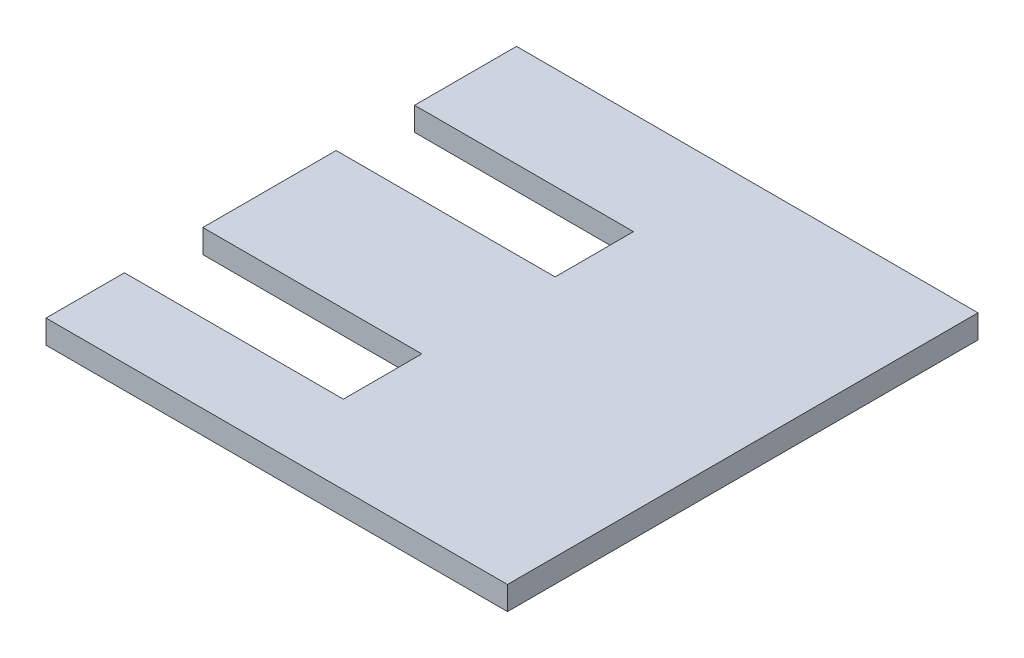
ISO-10303-21;
HEADER;
FILE_DESCRIPTION(('STEP AP214'),'2;1');
FILE_NAME('part.step','',(''),(''),'','','');
FILE_SCHEMA(('AUTOMOTIVE_DESIGN { 1 0 10303 214 1 1 1 1 }'));
ENDSEC;
DATA;
#1=APPLICATION_CONTEXT('core data for automotive mechanical design processes');
#2=APPLICATION_PROTOCOL_DEFINITION('international standard','automotive_design',2000,#1);
#3=PRODUCT_CONTEXT('',#1,'mechanical');
#4=PRODUCT('Part','Part','',(#3));
#5=PRODUCT_RELATED_PRODUCT_CATEGORY('part','',(#4));
#6=PRODUCT_DEFINITION_FORMATION('','',#4);
#7=PRODUCT_DEFINITION_CONTEXT('part definition',#1,'design');
#8=PRODUCT_DEFINITION('design','',#6,#7);
#9=PRODUCT_DEFINITION_SHAPE('','',#8);
#10=(LENGTH_UNIT() NAMED_UNIT(*) SI_UNIT(.MILLI.,.METRE.));
#11=(NAMED_UNIT(*) PLANE_ANGLE_UNIT() SI_UNIT($,.RADIAN.));
#12=(NAMED_UNIT(*) SI_UNIT($,.STERADIAN.) SOLID_ANGLE_UNIT());
#13=UNCERTAINTY_MEASURE_WITH_UNIT(LENGTH_MEASURE(1.E-05),#10,'distance_accuracy_value','');
#14=(GEOMETRIC_REPRESENTATION_CONTEXT(3) GLOBAL_UNCERTAINTY_ASSIGNED_CONTEXT((#13)) GLOBAL_UNIT_ASSIGNED_CONTEXT((#10,
#11,#12)) REPRESENTATION_CONTEXT('',''));
#15=CARTESIAN_POINT('',(0.,0.,0.));
#16=DIRECTION('',(0.,0.,1.));
#17=DIRECTION('',(1.,0.,0.));
#18=AXIS2_PLACEMENT_3D('',#15,#16,#17);
#19=CARTESIAN_POINT('',(-300.,46.99,40.));
#20=DIRECTION('',(0.,0.,-1.));
#21=DIRECTION('',(-1.,0.,0.));
#22=AXIS2_PLACEMENT_3D('',#19,#20,#21);
#23=PLANE('',#22);
#24=DIRECTION('',(0.,1.,0.));
#25=VECTOR('',#24,1.);
#26=CARTESIAN_POINT('',(-272.082574829783,46.99,40.));
#27=LINE('',#26,#25);
#28=CARTESIAN_POINT('',(-272.082574829783,47.,40.));
#29=VERTEX_POINT('',#28);
#30=CARTESIAN_POINT('',(-272.082574829783,50.,40.));
#31=VERTEX_POINT('',#30);
#32=EDGE_CURVE('E38',#29,#31,#27,.T.);
#33=ORIENTED_EDGE('',*,*,#32,.T.);
#34=DIRECTION('',(1.,0.,0.));
#35=VECTOR('',#34,1.);
#36=CARTESIAN_POINT('',(-300.,50.,40.));
#37=LINE('',#36,#35);
#38=CARTESIAN_POINT('',(-300.,50.,40.));
#39=VERTEX_POINT('',#38);
#40=EDGE_CURVE('E181',#39,#31,#37,.T.);
#41=ORIENTED_EDGE('',*,*,#40,.F.);
#42=DIRECTION('',(0.,-1.,0.));
#43=VECTOR('',#42,1.);
#44=CARTESIAN_POINT('',(-300.,46.99,40.));
#45=LINE('',#44,#43);
#46=CARTESIAN_POINT('',(-300.,47.,40.));
#47=VERTEX_POINT('',#46);
#48=EDGE_CURVE('E188',#39,#47,#45,.T.);
#49=ORIENTED_EDGE('',*,*,#48,.T.);
#50=DIRECTION('',(-1.,0.,0.));
#51=VECTOR('',#50,1.);
#52=CARTESIAN_POINT('',(300.,47.,40.));
#53=LINE('',#52,#51);
#54=EDGE_CURVE('E207',#29,#47,#53,.T.);
#55=ORIENTED_EDGE('',*,*,#54,.F.);
#56=EDGE_LOOP('',(#33,#41,#49,#55));
#57=FACE_BOUND('',#56,.T.);
#58=ADVANCED_FACE('F34',(#57),#23,.F.);
#59=CARTESIAN_POINT('',(-300.,46.99,50.));
#60=DIRECTION('',(0.,0.,1.));
#61=DIRECTION('',(1.,0.,0.));
#62=AXIS2_PLACEMENT_3D('',#59,#60,#61);
#63=PLANE('',#62);
#64=DIRECTION('',(0.,1.,0.));
#65=VECTOR('',#64,1.);
#66=CARTESIAN_POINT('',(-300.,46.99,50.));
#67=LINE('',#66,#65);
#68=CARTESIAN_POINT('',(-300.,47.,50.));
#69=VERTEX_POINT('',#68);
#70=CARTESIAN_POINT('',(-300.,50.,50.));
#71=VERTEX_POINT('',#70);
#72=EDGE_CURVE('E184',#69,#71,#67,.T.);
#73=ORIENTED_EDGE('',*,*,#72,.T.);
#74=DIRECTION('',(-1.,0.,0.));
#75=VECTOR('',#74,1.);
#76=CARTESIAN_POINT('',(-300.,50.,50.));
#77=LINE('',#76,#75);
#78=CARTESIAN_POINT('',(-272.082574829783,50.,50.));
#79=VERTEX_POINT('',#78);
#80=EDGE_CURVE('E171',#79,#71,#77,.T.);
#81=ORIENTED_EDGE('',*,*,#80,.F.);
#82=DIRECTION('',(0.,1.,0.));
#83=VECTOR('',#82,1.);
#84=CARTESIAN_POINT('',(-272.082574829783,46.99,50.));
#85=LINE('',#84,#83);
#86=CARTESIAN_POINT('',(-272.082574829783,47.,50.));
#87=VERTEX_POINT('',#86);
#88=EDGE_CURVE('E194',#87,#79,#85,.T.);
#89=ORIENTED_EDGE('',*,*,#88,.F.);
#90=DIRECTION('',(1.,0.,0.));
#91=VECTOR('',#90,1.);
#92=CARTESIAN_POINT('',(300.,47.,50.));
#93=LINE('',#92,#91);
#94=EDGE_CURVE('E137',#69,#87,#93,.T.);
#95=ORIENTED_EDGE('',*,*,#94,.F.);
#96=EDGE_LOOP('',(#73,#81,#89,#95));
#97=FACE_BOUND('',#96,.T.);
#98=ADVANCED_FACE('F219',(#97),#63,.F.);
#99=CARTESIAN_POINT('',(-272.082574829783,46.99,40.));
#100=DIRECTION('',(1.,0.,0.));
#101=DIRECTION('',(0.,0.,-1.));
#102=AXIS2_PLACEMENT_3D('',#99,#100,#101);
#103=PLANE('',#102);
#104=ORIENTED_EDGE('',*,*,#88,.T.);
#105=DIRECTION('',(0.,0.,1.));
#106=VECTOR('',#105,1.);
#107=CARTESIAN_POINT('',(-272.082574829783,50.,60.));
#108=LINE('',#107,#106);
#109=EDGE_CURVE('E209',#31,#79,#108,.T.);
#110=ORIENTED_EDGE('',*,*,#109,.F.);
#111=ORIENTED_EDGE('',*,*,#32,.F.);
#112=DIRECTION('',(0.,0.,-1.));
#113=VECTOR('',#112,1.);
#114=CARTESIAN_POINT('',(-272.082574829783,47.,3.));
#115=LINE('',#114,#113);
#116=EDGE_CURVE('E215',#87,#29,#115,.T.);
#117=ORIENTED_EDGE('',*,*,#116,.F.);
#118=EDGE_LOOP('',(#104,#110,#111,#117));
#119=FACE_BOUND('',#118,.T.);
#120=ADVANCED_FACE('F210',(#119),#103,.F.);
#121=CARTESIAN_POINT('',(-300.,46.99,23.));
#122=DIRECTION('',(0.,0.,1.));
#123=DIRECTION('',(1.,0.,0.));
#124=AXIS2_PLACEMENT_3D('',#121,#122,#123);
#125=PLANE('',#124);
#126=DIRECTION('',(0.,1.,0.));
#127=VECTOR('',#126,1.);
#128=CARTESIAN_POINT('',(-300.,46.99,23.));
#129=LINE('',#128,#127);
#130=CARTESIAN_POINT('',(-300.,47.,23.));
#131=VERTEX_POINT('',#130);
#132=CARTESIAN_POINT('',(-300.,50.,23.));
#133=VERTEX_POINT('',#132);
#134=EDGE_CURVE('E146',#131,#133,#129,.T.);
#135=ORIENTED_EDGE('',*,*,#134,.T.);
#136=DIRECTION('',(-1.,0.,0.));
#137=VECTOR('',#136,1.);
#138=CARTESIAN_POINT('',(-300.,50.,23.));
#139=LINE('',#138,#137);
#140=CARTESIAN_POINT('',(-272.082574829783,50.,23.));
#141=VERTEX_POINT('',#140);
#142=EDGE_CURVE('E157',#141,#133,#139,.T.);
#143=ORIENTED_EDGE('',*,*,#142,.F.);
#144=DIRECTION('',(0.,1.,0.));
#145=VECTOR('',#144,1.);
#146=CARTESIAN_POINT('',(-272.082574829783,46.99,23.));
#147=LINE('',#146,#145);
#148=CARTESIAN_POINT('',(-272.082574829783,47.,23.));
#149=VERTEX_POINT('',#148);
#150=EDGE_CURVE('E147',#149,#141,#147,.T.);
#151=ORIENTED_EDGE('',*,*,#150,.F.);
#152=DIRECTION('',(1.,0.,0.));
#153=VECTOR('',#152,1.);
#154=CARTESIAN_POINT('',(300.,47.,22.9999999999999));
#155=LINE('',#154,#153);
#156=EDGE_CURVE('E179',#131,#149,#155,.T.);
#157=ORIENTED_EDGE('',*,*,#156,.F.);
#158=EDGE_LOOP('',(#135,#143,#151,#157));
#159=FACE_BOUND('',#158,.T.);
#160=ADVANCED_FACE('F246',(#159),#125,.F.);
#161=CARTESIAN_POINT('',(-300.,46.99,13.));
#162=DIRECTION('',(0.,0.,-1.));
#163=DIRECTION('',(-1.,0.,0.));
#164=AXIS2_PLACEMENT_3D('',#161,#162,#163);
#165=PLANE('',#164);
#166=DIRECTION('',(0.,1.,0.));
#167=VECTOR('',#166,1.);
#168=CARTESIAN_POINT('',(-272.082574829783,46.99,13.));
#169=LINE('',#168,#167);
#170=CARTESIAN_POINT('',(-272.082574829783,47.,13.));
#171=VERTEX_POINT('',#170);
#172=CARTESIAN_POINT('',(-272.082574829783,50.,13.));
#173=VERTEX_POINT('',#172);
#174=EDGE_CURVE('E196',#171,#173,#169,.T.);
#175=ORIENTED_EDGE('',*,*,#174,.T.);
#176=DIRECTION('',(1.,0.,0.));
#177=VECTOR('',#176,1.);
#178=CARTESIAN_POINT('',(-300.,50.,13.));
#179=LINE('',#178,#177);
#180=CARTESIAN_POINT('',(-300.,50.,13.));
#181=VERTEX_POINT('',#180);
#182=EDGE_CURVE('E142',#181,#173,#179,.T.);
#183=ORIENTED_EDGE('',*,*,#182,.F.);
#184=DIRECTION('',(0.,-1.,0.));
#185=VECTOR('',#184,1.);
#186=CARTESIAN_POINT('',(-300.,46.99,13.));
#187=LINE('',#186,#185);
#188=CARTESIAN_POINT('',(-300.,47.,13.));
#189=VERTEX_POINT('',#188);
#190=EDGE_CURVE('E140',#181,#189,#187,.T.);
#191=ORIENTED_EDGE('',*,*,#190,.T.);
#192=DIRECTION('',(-1.,0.,0.));
#193=VECTOR('',#192,1.);
#194=CARTESIAN_POINT('',(300.,47.,13.));
#195=LINE('',#194,#193);
#196=EDGE_CURVE('E126',#171,#189,#195,.T.);
#197=ORIENTED_EDGE('',*,*,#196,.F.);
#198=EDGE_LOOP('',(#175,#183,#191,#197));
#199=FACE_BOUND('',#198,.T.);
#200=ADVANCED_FACE('F141',(#199),#165,.F.);
#201=CARTESIAN_POINT('',(-272.082574829783,46.99,13.));
#202=DIRECTION('',(1.,0.,0.));
#203=DIRECTION('',(0.,0.,-1.));
#204=AXIS2_PLACEMENT_3D('',#201,#202,#203);
#205=PLANE('',#204);
#206=ORIENTED_EDGE('',*,*,#150,.T.);
#207=DIRECTION('',(0.,0.,1.));
#208=VECTOR('',#207,1.);
#209=CARTESIAN_POINT('',(-272.082574829783,50.,60.));
#210=LINE('',#209,#208);
#211=EDGE_CURVE('E175',#173,#141,#210,.T.);
#212=ORIENTED_EDGE('',*,*,#211,.F.);
#213=ORIENTED_EDGE('',*,*,#174,.F.);
#214=DIRECTION('',(0.,0.,-1.));
#215=VECTOR('',#214,1.);
#216=CARTESIAN_POINT('',(-272.082574829783,47.,3.));
#217=LINE('',#216,#215);
#218=EDGE_CURVE('E133',#149,#171,#217,.T.);
#219=ORIENTED_EDGE('',*,*,#218,.F.);
#220=EDGE_LOOP('',(#206,#212,#213,#219));
#221=FACE_BOUND('',#220,.T.);
#222=ADVANCED_FACE('F244',(#221),#205,.F.);
#223=CARTESIAN_POINT('',(-241.153214372562,46.99,0.));
#224=DIRECTION('',(1.,0.,0.));
#225=DIRECTION('',(0.,0.,-1.));
#226=AXIS2_PLACEMENT_3D('',#223,#224,#225);
#227=PLANE('',#226);
#228=DIRECTION('',(0.,1.,0.));
#229=VECTOR('',#228,1.);
#230=CARTESIAN_POINT('',(-241.153214372562,46.99,60.));
#231=LINE('',#230,#229);
#232=CARTESIAN_POINT('',(-241.153214372562,47.,60.));
#233=VERTEX_POINT('',#232);
#234=CARTESIAN_POINT('',(-241.153214372562,50.,60.));
#235=VERTEX_POINT('',#234);
#236=EDGE_CURVE('E154',#233,#235,#231,.T.);
#237=ORIENTED_EDGE('',*,*,#236,.F.);
#238=DIRECTION('',(0.,0.,-1.));
#239=VECTOR('',#238,1.);
#240=CARTESIAN_POINT('',(-241.153214372562,47.,3.));
#241=LINE('',#240,#239);
#242=CARTESIAN_POINT('',(-241.153214372562,47.,0.));
#243=VERTEX_POINT('',#242);
#244=EDGE_CURVE('E217',#233,#243,#241,.T.);
#245=ORIENTED_EDGE('',*,*,#244,.T.);
#246=DIRECTION('',(0.,1.,0.));
#247=VECTOR('',#246,1.);
#248=CARTESIAN_POINT('',(-241.153214372562,46.99,0.));
#249=LINE('',#248,#247);
#250=CARTESIAN_POINT('',(-241.153214372562,50.,0.));
#251=VERTEX_POINT('',#250);
#252=EDGE_CURVE('E192',#243,#251,#249,.T.);
#253=ORIENTED_EDGE('',*,*,#252,.T.);
#254=DIRECTION('',(0.,0.,1.));
#255=VECTOR('',#254,1.);
#256=CARTESIAN_POINT('',(-241.153214372562,50.,60.));
#257=LINE('',#256,#255);
#258=EDGE_CURVE('E234',#251,#235,#257,.T.);
#259=ORIENTED_EDGE('',*,*,#258,.T.);
#260=EDGE_LOOP('',(#237,#245,#253,#259));
#261=FACE_BOUND('',#260,.T.);
#262=ADVANCED_FACE('F239',(#261),#227,.T.);
#263=CARTESIAN_POINT('',(-300.,0.,0.));
#264=DIRECTION('',(-1.,0.,0.));
#265=DIRECTION('',(0.,0.,1.));
#266=AXIS2_PLACEMENT_3D('',#263,#264,#265);
#267=PLANE('',#266);
#268=ORIENTED_EDGE('',*,*,#72,.F.);
#269=DIRECTION('',(0.,0.,1.));
#270=VECTOR('',#269,1.);
#271=CARTESIAN_POINT('',(-300.,47.,3.));
#272=LINE('',#271,#270);
#273=CARTESIAN_POINT('',(-300.,47.,60.));
#274=VERTEX_POINT('',#273);
#275=EDGE_CURVE('E51',#69,#274,#272,.T.);
#276=ORIENTED_EDGE('',*,*,#275,.T.);
#277=DIRECTION('',(0.,-1.,0.));
#278=VECTOR('',#277,1.);
#279=CARTESIAN_POINT('',(-300.,0.,60.));
#280=LINE('',#279,#278);
#281=CARTESIAN_POINT('',(-300.,50.,60.));
#282=VERTEX_POINT('',#281);
#283=EDGE_CURVE('E11',#282,#274,#280,.T.);
#284=ORIENTED_EDGE('',*,*,#283,.F.);
#285=DIRECTION('',(0.,0.,-1.));
#286=VECTOR('',#285,1.);
#287=CARTESIAN_POINT('',(-300.,50.,60.));
#288=LINE('',#287,#286);
#289=EDGE_CURVE('E160',#282,#71,#288,.T.);
#290=ORIENTED_EDGE('',*,*,#289,.T.);
#291=EDGE_LOOP('',(#268,#276,#284,#290));
#292=FACE_BOUND('',#291,.T.);
#293=ADVANCED_FACE('F222',(#292),#267,.T.);
#294=CARTESIAN_POINT('',(-300.,0.,60.));
#295=DIRECTION('',(0.,0.,1.));
#296=DIRECTION('',(1.,0.,0.));
#297=AXIS2_PLACEMENT_3D('',#294,#295,#296);
#298=PLANE('',#297);
#299=DIRECTION('',(-1.,0.,0.));
#300=VECTOR('',#299,1.);
#301=CARTESIAN_POINT('',(300.,47.,60.));
#302=LINE('',#301,#300);
#303=EDGE_CURVE('E225',#233,#274,#302,.T.);
#304=ORIENTED_EDGE('',*,*,#303,.F.);
#305=ORIENTED_EDGE('',*,*,#236,.T.);
#306=DIRECTION('',(-1.,0.,0.));
#307=VECTOR('',#306,1.);
#308=CARTESIAN_POINT('',(-300.,50.,60.));
#309=LINE('',#308,#307);
#310=EDGE_CURVE('E43',#235,#282,#309,.T.);
#311=ORIENTED_EDGE('',*,*,#310,.T.);
#312=ORIENTED_EDGE('',*,*,#283,.T.);
#313=EDGE_LOOP('',(#304,#305,#311,#312));
#314=FACE_BOUND('',#313,.T.);
#315=ADVANCED_FACE('F224',(#314),#298,.T.);
#316=CARTESIAN_POINT('',(-300.,50.,60.));
#317=DIRECTION('',(0.,-1.,0.));
#318=DIRECTION('',(0.,0.,-1.));
#319=AXIS2_PLACEMENT_3D('',#316,#317,#318);
#320=PLANE('',#319);
#321=EDGE_CURVE('E162',#39,#133,#288,.T.);
#322=ORIENTED_EDGE('',*,*,#321,.F.);
#323=ORIENTED_EDGE('',*,*,#40,.T.);
#324=ORIENTED_EDGE('',*,*,#109,.T.);
#325=ORIENTED_EDGE('',*,*,#80,.T.);
#326=ORIENTED_EDGE('',*,*,#289,.F.);
#327=ORIENTED_EDGE('',*,*,#310,.F.);
#328=ORIENTED_EDGE('',*,*,#258,.F.);
#329=DIRECTION('',(-1.,0.,0.));
#330=VECTOR('',#329,1.);
#331=CARTESIAN_POINT('',(-300.,50.,0.));
#332=LINE('',#331,#330);
#333=CARTESIAN_POINT('',(-300.,50.,0.));
#334=VERTEX_POINT('',#333);
#335=EDGE_CURVE('E168',#251,#334,#332,.T.);
#336=ORIENTED_EDGE('',*,*,#335,.T.);
#337=EDGE_CURVE('E163',#181,#334,#288,.T.);
#338=ORIENTED_EDGE('',*,*,#337,.F.);
#339=ORIENTED_EDGE('',*,*,#182,.T.);
#340=ORIENTED_EDGE('',*,*,#211,.T.);
#341=ORIENTED_EDGE('',*,*,#142,.T.);
#342=EDGE_LOOP('',(#322,#323,#324,#325,#326,#327,#328,#336,#338,#339,#340,#341));
#343=FACE_BOUND('',#342,.T.);
#344=ADVANCED_FACE('F220',(#343),#320,.F.);
#345=CARTESIAN_POINT('',(300.,47.,3.));
#346=DIRECTION('',(0.,1.,0.));
#347=DIRECTION('',(0.,0.,1.));
#348=AXIS2_PLACEMENT_3D('',#345,#346,#347);
#349=PLANE('',#348);
#350=ORIENTED_EDGE('',*,*,#116,.T.);
#351=ORIENTED_EDGE('',*,*,#54,.T.);
#352=EDGE_CURVE('E153',#131,#47,#272,.T.);
#353=ORIENTED_EDGE('',*,*,#352,.F.);
#354=ORIENTED_EDGE('',*,*,#156,.T.);
#355=ORIENTED_EDGE('',*,*,#218,.T.);
#356=ORIENTED_EDGE('',*,*,#196,.T.);
#357=CARTESIAN_POINT('',(-300.,47.,0.));
#358=VERTEX_POINT('',#357);
#359=EDGE_CURVE('E131',#358,#189,#272,.T.);
#360=ORIENTED_EDGE('',*,*,#359,.F.);
#361=DIRECTION('',(1.,0.,0.));
#362=VECTOR('',#361,1.);
#363=CARTESIAN_POINT('',(-300.,47.,0.));
#364=LINE('',#363,#362);
#365=EDGE_CURVE('E166',#358,#243,#364,.T.);
#366=ORIENTED_EDGE('',*,*,#365,.T.);
#367=ORIENTED_EDGE('',*,*,#244,.F.);
#368=ORIENTED_EDGE('',*,*,#303,.T.);
#369=ORIENTED_EDGE('',*,*,#275,.F.);
#370=ORIENTED_EDGE('',*,*,#94,.T.);
#371=EDGE_LOOP('',(#350,#351,#353,#354,#355,#356,#360,#366,#367,#368,#369,#370));
#372=FACE_BOUND('',#371,.T.);
#373=ADVANCED_FACE('F129',(#372),#349,.F.);
#374=ORIENTED_EDGE('',*,*,#190,.F.);
#375=ORIENTED_EDGE('',*,*,#337,.T.);
#376=DIRECTION('',(0.,-1.,0.));
#377=VECTOR('',#376,1.);
#378=CARTESIAN_POINT('',(-300.,0.,0.));
#379=LINE('',#378,#377);
#380=EDGE_CURVE('E152',#334,#358,#379,.T.);
#381=ORIENTED_EDGE('',*,*,#380,.T.);
#382=ORIENTED_EDGE('',*,*,#359,.T.);
#383=EDGE_LOOP('',(#374,#375,#381,#382));
#384=FACE_BOUND('',#383,.T.);
#385=ADVANCED_FACE('F150',(#384),#267,.T.);
#386=ORIENTED_EDGE('',*,*,#48,.F.);
#387=ORIENTED_EDGE('',*,*,#321,.T.);
#388=ORIENTED_EDGE('',*,*,#134,.F.);
#389=ORIENTED_EDGE('',*,*,#352,.T.);
#390=EDGE_LOOP('',(#386,#387,#388,#389));
#391=FACE_BOUND('',#390,.T.);
#392=ADVANCED_FACE('F248',(#391),#267,.T.);
#393=CARTESIAN_POINT('',(-300.,0.,0.));
#394=DIRECTION('',(0.,0.,1.));
#395=DIRECTION('',(1.,0.,0.));
#396=AXIS2_PLACEMENT_3D('',#393,#394,#395);
#397=PLANE('',#396);
#398=ORIENTED_EDGE('',*,*,#252,.F.);
#399=ORIENTED_EDGE('',*,*,#365,.F.);
#400=ORIENTED_EDGE('',*,*,#380,.F.);
#401=ORIENTED_EDGE('',*,*,#335,.F.);
#402=EDGE_LOOP('',(#398,#399,#400,#401));
#403=FACE_BOUND('',#402,.T.);
#404=ADVANCED_FACE('F36',(#403),#397,.F.);
#405=CLOSED_SHELL('',(#58,#98,#120,#160,#200,#222,#262,#293,#315,#344,#373,#385,#392,#404));
#406=MANIFOLD_SOLID_BREP('B2',#405);
#407=ADVANCED_BREP_SHAPE_REPRESENTATION('',(#18,#406),#14);
#408=SHAPE_DEFINITION_REPRESENTATION(#9,#407);
ENDSEC;
END-ISO-10303-21;
